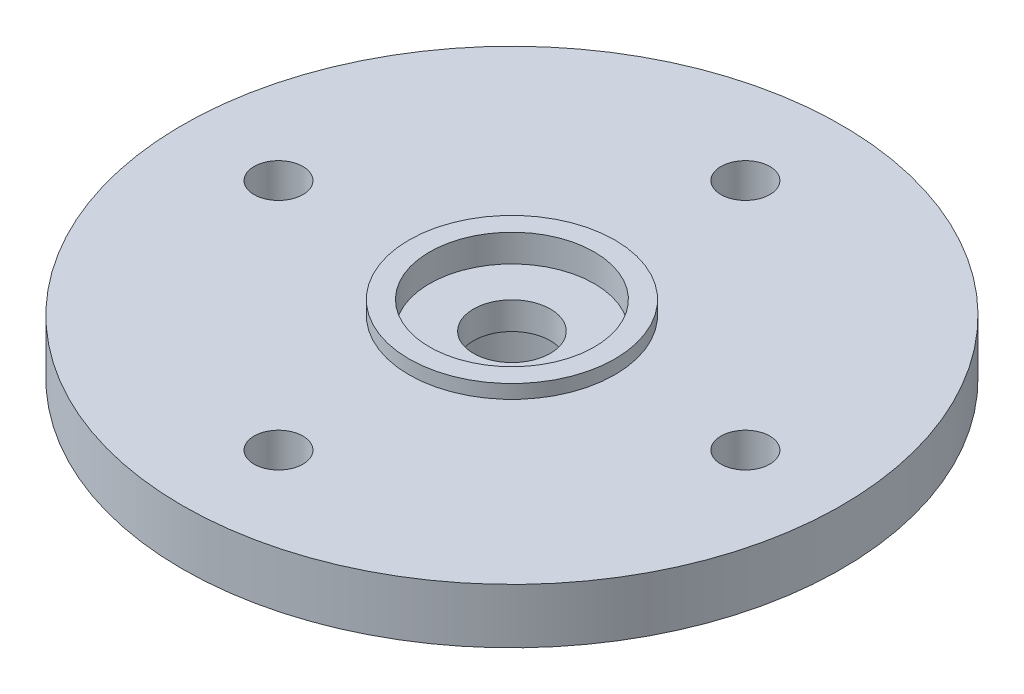
ISO-10303-21;
HEADER;
FILE_DESCRIPTION(('STEP AP214'),'2;1');
FILE_NAME('part.step','',(''),(''),'','','');
FILE_SCHEMA(('AUTOMOTIVE_DESIGN { 1 0 10303 214 1 1 1 1 }'));
ENDSEC;
DATA;
#1=APPLICATION_CONTEXT('core data for automotive mechanical design processes');
#2=APPLICATION_PROTOCOL_DEFINITION('international standard','automotive_design',2000,#1);
#3=PRODUCT_CONTEXT('',#1,'mechanical');
#4=PRODUCT('Part','Part','',(#3));
#5=PRODUCT_RELATED_PRODUCT_CATEGORY('part','',(#4));
#6=PRODUCT_DEFINITION_FORMATION('','',#4);
#7=PRODUCT_DEFINITION_CONTEXT('part definition',#1,'design');
#8=PRODUCT_DEFINITION('design','',#6,#7);
#9=PRODUCT_DEFINITION_SHAPE('','',#8);
#10=(LENGTH_UNIT() NAMED_UNIT(*) SI_UNIT(.MILLI.,.METRE.));
#11=(NAMED_UNIT(*) PLANE_ANGLE_UNIT() SI_UNIT($,.RADIAN.));
#12=(NAMED_UNIT(*) SI_UNIT($,.STERADIAN.) SOLID_ANGLE_UNIT());
#13=UNCERTAINTY_MEASURE_WITH_UNIT(LENGTH_MEASURE(1.E-05),#10,'distance_accuracy_value','');
#14=(GEOMETRIC_REPRESENTATION_CONTEXT(3) GLOBAL_UNCERTAINTY_ASSIGNED_CONTEXT((#13)) GLOBAL_UNIT_ASSIGNED_CONTEXT((#10,
#11,#12)) REPRESENTATION_CONTEXT('',''));
#15=CARTESIAN_POINT('',(0.,0.,0.));
#16=DIRECTION('',(0.,0.,1.));
#17=DIRECTION('',(1.,0.,0.));
#18=AXIS2_PLACEMENT_3D('',#15,#16,#17);
#19=CARTESIAN_POINT('',(-44.069,68.05714,0.));
#20=DIRECTION('',(0.,1.,0.));
#21=DIRECTION('',(0.,0.,1.));
#22=AXIS2_PLACEMENT_3D('',#19,#20,#21);
#23=CYLINDRICAL_SURFACE('',#22,12.);
#24=CARTESIAN_POINT('',(-44.069,68.05714,0.));
#25=DIRECTION('',(0.,1.,0.));
#26=DIRECTION('',(0.,0.,1.));
#27=AXIS2_PLACEMENT_3D('',#24,#25,#26);
#28=CIRCLE('',#27,12.);
#29=CARTESIAN_POINT('',(-44.069,68.05714,12.));
#30=VERTEX_POINT('',#29);
#31=EDGE_CURVE('E44',#30,#30,#28,.T.);
#32=ORIENTED_EDGE('',*,*,#31,.T.);
#33=EDGE_LOOP('',(#32));
#34=FACE_BOUND('',#33,.T.);
#35=CARTESIAN_POINT('',(-44.069,70.05714,0.));
#36=DIRECTION('',(0.,1.,0.));
#37=DIRECTION('',(0.,0.,1.));
#38=AXIS2_PLACEMENT_3D('',#35,#36,#37);
#39=CIRCLE('',#38,12.);
#40=CARTESIAN_POINT('',(-44.069,70.05714,12.));
#41=VERTEX_POINT('',#40);
#42=EDGE_CURVE('E52',#41,#41,#39,.T.);
#43=ORIENTED_EDGE('',*,*,#42,.F.);
#44=EDGE_LOOP('',(#43));
#45=FACE_BOUND('',#44,.T.);
#46=ADVANCED_FACE('F32',(#34,#45),#23,.T.);
#47=CARTESIAN_POINT('',(-32.069,68.05714,0.));
#48=DIRECTION('',(0.,-1.,0.));
#49=DIRECTION('',(0.,0.,-1.));
#50=AXIS2_PLACEMENT_3D('',#47,#48,#49);
#51=PLANE('',#50);
#52=CARTESIAN_POINT('',(-44.069,68.05714,-8.5));
#53=DIRECTION('',(0.,-1.,0.));
#54=DIRECTION('',(0.,0.,-1.));
#55=AXIS2_PLACEMENT_3D('',#52,#53,#54);
#56=CIRCLE('',#55,0.888999999999973);
#57=CARTESIAN_POINT('',(-44.069,68.05714,-9.38899999999997));
#58=VERTEX_POINT('',#57);
#59=EDGE_CURVE('E130',#58,#58,#56,.T.);
#60=ORIENTED_EDGE('',*,*,#59,.F.);
#61=EDGE_LOOP('',(#60));
#62=FACE_BOUND('',#61,.T.);
#63=CARTESIAN_POINT('',(-52.569,68.05714,0.));
#64=DIRECTION('',(0.,-1.,0.));
#65=DIRECTION('',(0.,0.,-1.));
#66=AXIS2_PLACEMENT_3D('',#63,#64,#65);
#67=CIRCLE('',#66,0.888999999999973);
#68=CARTESIAN_POINT('',(-52.569,68.05714,-0.888999999999973));
#69=VERTEX_POINT('',#68);
#70=EDGE_CURVE('E132',#69,#69,#67,.T.);
#71=ORIENTED_EDGE('',*,*,#70,.F.);
#72=EDGE_LOOP('',(#71));
#73=FACE_BOUND('',#72,.T.);
#74=CARTESIAN_POINT('',(-35.569,68.05714,0.));
#75=DIRECTION('',(0.,-1.,0.));
#76=DIRECTION('',(0.,0.,-1.));
#77=AXIS2_PLACEMENT_3D('',#74,#75,#76);
#78=CIRCLE('',#77,0.888999999999973);
#79=CARTESIAN_POINT('',(-35.569,68.05714,-0.888999999999973));
#80=VERTEX_POINT('',#79);
#81=EDGE_CURVE('E139',#80,#80,#78,.T.);
#82=ORIENTED_EDGE('',*,*,#81,.F.);
#83=EDGE_LOOP('',(#82));
#84=FACE_BOUND('',#83,.T.);
#85=CARTESIAN_POINT('',(-44.069,68.05714,8.5));
#86=DIRECTION('',(0.,-1.,0.));
#87=DIRECTION('',(0.,0.,-1.));
#88=AXIS2_PLACEMENT_3D('',#85,#86,#87);
#89=CIRCLE('',#88,0.888999999999973);
#90=CARTESIAN_POINT('',(-44.069,68.05714,7.61100000000003));
#91=VERTEX_POINT('',#90);
#92=EDGE_CURVE('E145',#91,#91,#89,.T.);
#93=ORIENTED_EDGE('',*,*,#92,.F.);
#94=EDGE_LOOP('',(#93));
#95=FACE_BOUND('',#94,.T.);
#96=CARTESIAN_POINT('',(-44.069,68.05714,0.));
#97=DIRECTION('',(0.,-1.,0.));
#98=DIRECTION('',(0.,0.,-1.));
#99=AXIS2_PLACEMENT_3D('',#96,#97,#98);
#100=CIRCLE('',#99,4.5);
#101=CARTESIAN_POINT('',(-44.069,68.05714,-4.5));
#102=VERTEX_POINT('',#101);
#103=EDGE_CURVE('E39',#102,#102,#100,.T.);
#104=ORIENTED_EDGE('',*,*,#103,.F.);
#105=EDGE_LOOP('',(#104));
#106=FACE_BOUND('',#105,.T.);
#107=ORIENTED_EDGE('',*,*,#31,.F.);
#108=EDGE_LOOP('',(#107));
#109=FACE_BOUND('',#108,.T.);
#110=ADVANCED_FACE('F60',(#62,#73,#84,#95,#106,#109),#51,.T.);
#111=CARTESIAN_POINT('',(-44.069,70.05714,0.));
#112=DIRECTION('',(0.,1.,0.));
#113=DIRECTION('',(0.,0.,1.));
#114=AXIS2_PLACEMENT_3D('',#111,#112,#113);
#115=PLANE('',#114);
#116=CARTESIAN_POINT('',(-44.069,70.05714,-8.5));
#117=DIRECTION('',(0.,1.,0.));
#118=DIRECTION('',(0.,0.,1.));
#119=AXIS2_PLACEMENT_3D('',#116,#117,#118);
#120=CIRCLE('',#119,0.888999999999973);
#121=CARTESIAN_POINT('',(-44.069,70.05714,-7.61100000000003));
#122=VERTEX_POINT('',#121);
#123=EDGE_CURVE('E35',#122,#122,#120,.T.);
#124=ORIENTED_EDGE('',*,*,#123,.F.);
#125=EDGE_LOOP('',(#124));
#126=FACE_BOUND('',#125,.T.);
#127=CARTESIAN_POINT('',(-52.569,70.05714,0.));
#128=DIRECTION('',(0.,1.,0.));
#129=DIRECTION('',(0.,0.,1.));
#130=AXIS2_PLACEMENT_3D('',#127,#128,#129);
#131=CIRCLE('',#130,0.888999999999973);
#132=CARTESIAN_POINT('',(-52.569,70.05714,0.888999999999973));
#133=VERTEX_POINT('',#132);
#134=EDGE_CURVE('E136',#133,#133,#131,.T.);
#135=ORIENTED_EDGE('',*,*,#134,.F.);
#136=EDGE_LOOP('',(#135));
#137=FACE_BOUND('',#136,.T.);
#138=CARTESIAN_POINT('',(-35.569,70.05714,0.));
#139=DIRECTION('',(0.,1.,0.));
#140=DIRECTION('',(0.,0.,1.));
#141=AXIS2_PLACEMENT_3D('',#138,#139,#140);
#142=CIRCLE('',#141,0.888999999999973);
#143=CARTESIAN_POINT('',(-35.569,70.05714,0.888999999999973));
#144=VERTEX_POINT('',#143);
#145=EDGE_CURVE('E142',#144,#144,#142,.T.);
#146=ORIENTED_EDGE('',*,*,#145,.F.);
#147=EDGE_LOOP('',(#146));
#148=FACE_BOUND('',#147,.T.);
#149=CARTESIAN_POINT('',(-44.069,70.05714,8.5));
#150=DIRECTION('',(0.,1.,0.));
#151=DIRECTION('',(0.,0.,1.));
#152=AXIS2_PLACEMENT_3D('',#149,#150,#151);
#153=CIRCLE('',#152,0.888999999999973);
#154=CARTESIAN_POINT('',(-44.069,70.05714,9.38899999999997));
#155=VERTEX_POINT('',#154);
#156=EDGE_CURVE('E148',#155,#155,#153,.T.);
#157=ORIENTED_EDGE('',*,*,#156,.F.);
#158=EDGE_LOOP('',(#157));
#159=FACE_BOUND('',#158,.T.);
#160=CARTESIAN_POINT('',(-44.069,70.05714,0.));
#161=DIRECTION('',(0.,1.,0.));
#162=DIRECTION('',(0.,0.,1.));
#163=AXIS2_PLACEMENT_3D('',#160,#161,#162);
#164=CIRCLE('',#163,3.75);
#165=CARTESIAN_POINT('',(-44.069,70.05714,3.75));
#166=VERTEX_POINT('',#165);
#167=EDGE_CURVE('E10',#166,#166,#164,.T.);
#168=ORIENTED_EDGE('',*,*,#167,.F.);
#169=EDGE_LOOP('',(#168));
#170=FACE_BOUND('',#169,.T.);
#171=ORIENTED_EDGE('',*,*,#42,.T.);
#172=EDGE_LOOP('',(#171));
#173=FACE_BOUND('',#172,.T.);
#174=ADVANCED_FACE('F62',(#126,#137,#148,#159,#170,#173),#115,.T.);
#175=CARTESIAN_POINT('',(-44.069,65.55714,0.));
#176=DIRECTION('',(0.,1.,0.));
#177=DIRECTION('',(0.,0.,1.));
#178=AXIS2_PLACEMENT_3D('',#175,#176,#177);
#179=CYLINDRICAL_SURFACE('',#178,4.5);
#180=CARTESIAN_POINT('',(-44.069,65.55714,0.));
#181=DIRECTION('',(0.,-1.,0.));
#182=DIRECTION('',(0.,0.,-1.));
#183=AXIS2_PLACEMENT_3D('',#180,#181,#182);
#184=CIRCLE('',#183,4.5);
#185=CARTESIAN_POINT('',(-44.069,65.55714,-4.5));
#186=VERTEX_POINT('',#185);
#187=EDGE_CURVE('E50',#186,#186,#184,.T.);
#188=ORIENTED_EDGE('',*,*,#187,.F.);
#189=EDGE_LOOP('',(#188));
#190=FACE_BOUND('',#189,.T.);
#191=ORIENTED_EDGE('',*,*,#103,.T.);
#192=EDGE_LOOP('',(#191));
#193=FACE_BOUND('',#192,.T.);
#194=ADVANCED_FACE('F68',(#190,#193),#179,.T.);
#195=CARTESIAN_POINT('',(-44.069,65.55714,0.));
#196=DIRECTION('',(0.,-1.,0.));
#197=DIRECTION('',(0.,0.,-1.));
#198=AXIS2_PLACEMENT_3D('',#195,#196,#197);
#199=PLANE('',#198);
#200=CARTESIAN_POINT('',(-44.069,65.55714,0.));
#201=DIRECTION('',(0.,-1.,0.));
#202=DIRECTION('',(0.,0.,-1.));
#203=AXIS2_PLACEMENT_3D('',#200,#201,#202);
#204=CIRCLE('',#203,3.);
#205=CARTESIAN_POINT('',(-44.069,65.55714,-3.));
#206=VERTEX_POINT('',#205);
#207=EDGE_CURVE('E163',#206,#206,#204,.T.);
#208=ORIENTED_EDGE('',*,*,#207,.F.);
#209=EDGE_LOOP('',(#208));
#210=FACE_BOUND('',#209,.T.);
#211=ORIENTED_EDGE('',*,*,#187,.T.);
#212=EDGE_LOOP('',(#211));
#213=FACE_BOUND('',#212,.T.);
#214=ADVANCED_FACE('F76',(#210,#213),#199,.T.);
#215=CARTESIAN_POINT('',(-44.069,70.55714,0.));
#216=DIRECTION('',(0.,-1.,0.));
#217=DIRECTION('',(0.,0.,-1.));
#218=AXIS2_PLACEMENT_3D('',#215,#216,#217);
#219=CYLINDRICAL_SURFACE('',#218,3.75);
#220=CARTESIAN_POINT('',(-44.069,70.55714,0.));
#221=DIRECTION('',(0.,1.,0.));
#222=DIRECTION('',(0.,0.,1.));
#223=AXIS2_PLACEMENT_3D('',#220,#221,#222);
#224=CIRCLE('',#223,3.75);
#225=CARTESIAN_POINT('',(-44.069,70.55714,3.75));
#226=VERTEX_POINT('',#225);
#227=EDGE_CURVE('E48',#226,#226,#224,.T.);
#228=ORIENTED_EDGE('',*,*,#227,.F.);
#229=EDGE_LOOP('',(#228));
#230=FACE_BOUND('',#229,.T.);
#231=ORIENTED_EDGE('',*,*,#167,.T.);
#232=EDGE_LOOP('',(#231));
#233=FACE_BOUND('',#232,.T.);
#234=ADVANCED_FACE('F80',(#230,#233),#219,.T.);
#235=CARTESIAN_POINT('',(-44.069,70.55714,0.));
#236=DIRECTION('',(0.,1.,0.));
#237=DIRECTION('',(0.,0.,1.));
#238=AXIS2_PLACEMENT_3D('',#235,#236,#237);
#239=PLANE('',#238);
#240=CARTESIAN_POINT('',(-44.069,70.55714,0.));
#241=DIRECTION('',(0.,-1.,0.));
#242=DIRECTION('',(0.,0.,-1.));
#243=AXIS2_PLACEMENT_3D('',#240,#241,#242);
#244=CIRCLE('',#243,3.);
#245=CARTESIAN_POINT('',(-44.069,70.55714,-3.));
#246=VERTEX_POINT('',#245);
#247=EDGE_CURVE('E165',#246,#246,#244,.T.);
#248=ORIENTED_EDGE('',*,*,#247,.T.);
#249=EDGE_LOOP('',(#248));
#250=FACE_BOUND('',#249,.T.);
#251=ORIENTED_EDGE('',*,*,#227,.T.);
#252=EDGE_LOOP('',(#251));
#253=FACE_BOUND('',#252,.T.);
#254=ADVANCED_FACE('F84',(#250,#253),#239,.T.);
#255=CARTESIAN_POINT('',(-44.069,70.55714,0.));
#256=DIRECTION('',(0.,-1.,0.));
#257=DIRECTION('',(0.,0.,-1.));
#258=AXIS2_PLACEMENT_3D('',#255,#256,#257);
#259=CYLINDRICAL_SURFACE('',#258,3.);
#260=ORIENTED_EDGE('',*,*,#247,.F.);
#261=EDGE_LOOP('',(#260));
#262=FACE_BOUND('',#261,.T.);
#263=CARTESIAN_POINT('',(-44.069,69.55714,0.));
#264=DIRECTION('',(0.,-1.,0.));
#265=DIRECTION('',(0.,0.,-1.));
#266=AXIS2_PLACEMENT_3D('',#263,#264,#265);
#267=CIRCLE('',#266,3.);
#268=CARTESIAN_POINT('',(-44.069,69.55714,-3.));
#269=VERTEX_POINT('',#268);
#270=EDGE_CURVE('E151',#269,#269,#267,.T.);
#271=ORIENTED_EDGE('',*,*,#270,.T.);
#272=EDGE_LOOP('',(#271));
#273=FACE_BOUND('',#272,.T.);
#274=ADVANCED_FACE('F88',(#262,#273),#259,.F.);
#275=CARTESIAN_POINT('',(-44.069,70.55714,0.));
#276=DIRECTION('',(0.,-1.,0.));
#277=DIRECTION('',(0.,0.,-1.));
#278=AXIS2_PLACEMENT_3D('',#275,#276,#277);
#279=CYLINDRICAL_SURFACE('',#278,3.);
#280=CARTESIAN_POINT('',(-44.069,68.55714,0.));
#281=DIRECTION('',(0.,-1.,0.));
#282=DIRECTION('',(0.,0.,-1.));
#283=AXIS2_PLACEMENT_3D('',#280,#281,#282);
#284=CIRCLE('',#283,3.);
#285=CARTESIAN_POINT('',(-44.069,68.55714,-3.));
#286=VERTEX_POINT('',#285);
#287=EDGE_CURVE('E160',#286,#286,#284,.T.);
#288=ORIENTED_EDGE('',*,*,#287,.F.);
#289=EDGE_LOOP('',(#288));
#290=FACE_BOUND('',#289,.T.);
#291=ORIENTED_EDGE('',*,*,#207,.T.);
#292=EDGE_LOOP('',(#291));
#293=FACE_BOUND('',#292,.T.);
#294=ADVANCED_FACE('F92',(#290,#293),#279,.F.);
#295=CARTESIAN_POINT('',(-41.069,68.55714,0.));
#296=DIRECTION('',(0.,1.,0.));
#297=DIRECTION('',(0.,0.,1.));
#298=AXIS2_PLACEMENT_3D('',#295,#296,#297);
#299=PLANE('',#298);
#300=CARTESIAN_POINT('',(-44.069,68.55714,0.));
#301=DIRECTION('',(0.,-1.,0.));
#302=DIRECTION('',(0.,0.,-1.));
#303=AXIS2_PLACEMENT_3D('',#300,#301,#302);
#304=CIRCLE('',#303,1.4);
#305=CARTESIAN_POINT('',(-44.069,68.55714,-1.4));
#306=VERTEX_POINT('',#305);
#307=EDGE_CURVE('E157',#306,#306,#304,.T.);
#308=ORIENTED_EDGE('',*,*,#307,.F.);
#309=EDGE_LOOP('',(#308));
#310=FACE_BOUND('',#309,.T.);
#311=ORIENTED_EDGE('',*,*,#287,.T.);
#312=EDGE_LOOP('',(#311));
#313=FACE_BOUND('',#312,.T.);
#314=ADVANCED_FACE('F96',(#310,#313),#299,.F.);
#315=CARTESIAN_POINT('',(-44.069,70.55714,0.));
#316=DIRECTION('',(0.,-1.,0.));
#317=DIRECTION('',(0.,0.,-1.));
#318=AXIS2_PLACEMENT_3D('',#315,#316,#317);
#319=CYLINDRICAL_SURFACE('',#318,1.4);
#320=CARTESIAN_POINT('',(-44.069,69.55714,0.));
#321=DIRECTION('',(0.,-1.,0.));
#322=DIRECTION('',(0.,0.,-1.));
#323=AXIS2_PLACEMENT_3D('',#320,#321,#322);
#324=CIRCLE('',#323,1.4);
#325=CARTESIAN_POINT('',(-44.069,69.55714,-1.4));
#326=VERTEX_POINT('',#325);
#327=EDGE_CURVE('E154',#326,#326,#324,.T.);
#328=ORIENTED_EDGE('',*,*,#327,.F.);
#329=EDGE_LOOP('',(#328));
#330=FACE_BOUND('',#329,.T.);
#331=ORIENTED_EDGE('',*,*,#307,.T.);
#332=EDGE_LOOP('',(#331));
#333=FACE_BOUND('',#332,.T.);
#334=ADVANCED_FACE('F100',(#330,#333),#319,.F.);
#335=CARTESIAN_POINT('',(-42.669,69.55714,0.));
#336=DIRECTION('',(0.,-1.,0.));
#337=DIRECTION('',(0.,0.,-1.));
#338=AXIS2_PLACEMENT_3D('',#335,#336,#337);
#339=PLANE('',#338);
#340=ORIENTED_EDGE('',*,*,#270,.F.);
#341=EDGE_LOOP('',(#340));
#342=FACE_BOUND('',#341,.T.);
#343=ORIENTED_EDGE('',*,*,#327,.T.);
#344=EDGE_LOOP('',(#343));
#345=FACE_BOUND('',#344,.T.);
#346=ADVANCED_FACE('F104',(#342,#345),#339,.F.);
#347=CARTESIAN_POINT('',(-44.069,68.05714,8.5));
#348=DIRECTION('',(0.,-1.,0.));
#349=DIRECTION('',(0.,0.,-1.));
#350=AXIS2_PLACEMENT_3D('',#347,#348,#349);
#351=CYLINDRICAL_SURFACE('',#350,0.888999999999973);
#352=ORIENTED_EDGE('',*,*,#156,.T.);
#353=EDGE_LOOP('',(#352));
#354=FACE_BOUND('',#353,.T.);
#355=ORIENTED_EDGE('',*,*,#92,.T.);
#356=EDGE_LOOP('',(#355));
#357=FACE_BOUND('',#356,.T.);
#358=ADVANCED_FACE('F108',(#354,#357),#351,.F.);
#359=CARTESIAN_POINT('',(-35.569,68.05714,0.));
#360=DIRECTION('',(0.,-1.,0.));
#361=DIRECTION('',(0.,0.,-1.));
#362=AXIS2_PLACEMENT_3D('',#359,#360,#361);
#363=CYLINDRICAL_SURFACE('',#362,0.888999999999973);
#364=ORIENTED_EDGE('',*,*,#145,.T.);
#365=EDGE_LOOP('',(#364));
#366=FACE_BOUND('',#365,.T.);
#367=ORIENTED_EDGE('',*,*,#81,.T.);
#368=EDGE_LOOP('',(#367));
#369=FACE_BOUND('',#368,.T.);
#370=ADVANCED_FACE('F112',(#366,#369),#363,.F.);
#371=CARTESIAN_POINT('',(-52.569,68.05714,0.));
#372=DIRECTION('',(0.,-1.,0.));
#373=DIRECTION('',(0.,0.,-1.));
#374=AXIS2_PLACEMENT_3D('',#371,#372,#373);
#375=CYLINDRICAL_SURFACE('',#374,0.888999999999973);
#376=ORIENTED_EDGE('',*,*,#134,.T.);
#377=EDGE_LOOP('',(#376));
#378=FACE_BOUND('',#377,.T.);
#379=ORIENTED_EDGE('',*,*,#70,.T.);
#380=EDGE_LOOP('',(#379));
#381=FACE_BOUND('',#380,.T.);
#382=ADVANCED_FACE('F116',(#378,#381),#375,.F.);
#383=CARTESIAN_POINT('',(-44.069,68.05714,-8.5));
#384=DIRECTION('',(0.,-1.,0.));
#385=DIRECTION('',(0.,0.,-1.));
#386=AXIS2_PLACEMENT_3D('',#383,#384,#385);
#387=CYLINDRICAL_SURFACE('',#386,0.888999999999973);
#388=ORIENTED_EDGE('',*,*,#123,.T.);
#389=EDGE_LOOP('',(#388));
#390=FACE_BOUND('',#389,.T.);
#391=ORIENTED_EDGE('',*,*,#59,.T.);
#392=EDGE_LOOP('',(#391));
#393=FACE_BOUND('',#392,.T.);
#394=ADVANCED_FACE('F120',(#390,#393),#387,.F.);
#395=CLOSED_SHELL('',(#46,#110,#174,#194,#214,#234,#254,#274,#294,#314,#334,#346,#358,#370,#382,#394));
#396=MANIFOLD_SOLID_BREP('B2',#395);
#397=ADVANCED_BREP_SHAPE_REPRESENTATION('',(#18,#396),#14);
#398=SHAPE_DEFINITION_REPRESENTATION(#9,#397);
ENDSEC;
END-ISO-10303-21;
